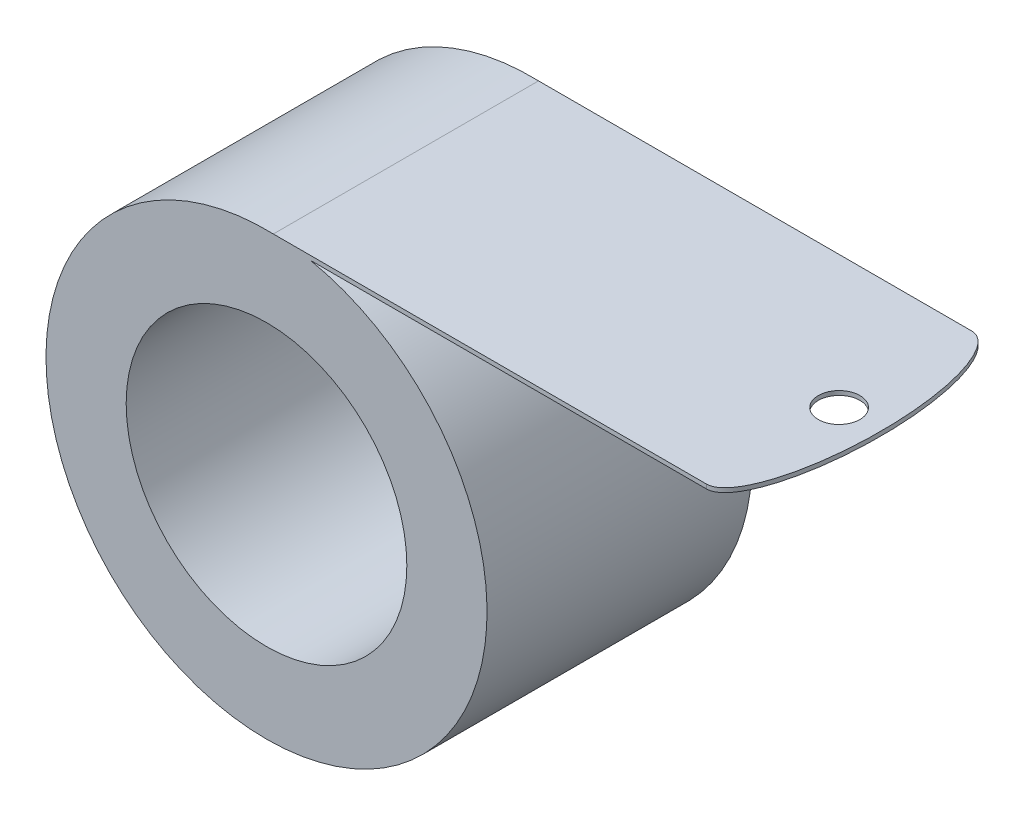
ISO-10303-21;
HEADER;
FILE_DESCRIPTION(('STEP AP214'),'2;1');
FILE_NAME('part.step','',(''),(''),'','','');
FILE_SCHEMA(('AUTOMOTIVE_DESIGN { 1 0 10303 214 1 1 1 1 }'));
ENDSEC;
DATA;
#1=APPLICATION_CONTEXT('core data for automotive mechanical design processes');
#2=APPLICATION_PROTOCOL_DEFINITION('international standard','automotive_design',2000,#1);
#3=PRODUCT_CONTEXT('',#1,'mechanical');
#4=PRODUCT('Part','Part','',(#3));
#5=PRODUCT_RELATED_PRODUCT_CATEGORY('part','',(#4));
#6=PRODUCT_DEFINITION_FORMATION('','',#4);
#7=PRODUCT_DEFINITION_CONTEXT('part definition',#1,'design');
#8=PRODUCT_DEFINITION('design','',#6,#7);
#9=PRODUCT_DEFINITION_SHAPE('','',#8);
#10=(LENGTH_UNIT() NAMED_UNIT(*) SI_UNIT(.MILLI.,.METRE.));
#11=(NAMED_UNIT(*) PLANE_ANGLE_UNIT() SI_UNIT($,.RADIAN.));
#12=(NAMED_UNIT(*) SI_UNIT($,.STERADIAN.) SOLID_ANGLE_UNIT());
#13=UNCERTAINTY_MEASURE_WITH_UNIT(LENGTH_MEASURE(1.E-05),#10,'distance_accuracy_value','');
#14=(GEOMETRIC_REPRESENTATION_CONTEXT(3) GLOBAL_UNCERTAINTY_ASSIGNED_CONTEXT((#13)) GLOBAL_UNIT_ASSIGNED_CONTEXT((#10,
#11,#12)) REPRESENTATION_CONTEXT('',''));
#15=CARTESIAN_POINT('',(0.,0.,0.));
#16=DIRECTION('',(0.,0.,1.));
#17=DIRECTION('',(1.,0.,0.));
#18=AXIS2_PLACEMENT_3D('',#15,#16,#17);
#19=CARTESIAN_POINT('',(0.,0.,31.75));
#20=DIRECTION('',(0.,0.,1.));
#21=DIRECTION('',(1.,0.,0.));
#22=AXIS2_PLACEMENT_3D('',#19,#20,#21);
#23=PLANE('',#22);
#24=DIRECTION('',(1.,0.,0.));
#25=VECTOR('',#24,1.);
#26=CARTESIAN_POINT('',(0.,26.3906,31.75));
#27=LINE('',#26,#25);
#28=CARTESIAN_POINT('',(0.818829976246884,26.3906,31.75));
#29=VERTEX_POINT('',#28);
#30=CARTESIAN_POINT('',(52.6813929222527,26.3906,31.75));
#31=VERTEX_POINT('',#30);
#32=EDGE_CURVE('E80',#29,#31,#27,.T.);
#33=ORIENTED_EDGE('',*,*,#32,.F.);
#34=CARTESIAN_POINT('',(0.,0.,31.75));
#35=DIRECTION('',(0.,0.,1.));
#36=DIRECTION('',(1.,0.,0.));
#37=AXIS2_PLACEMENT_3D('',#34,#35,#36);
#38=CIRCLE('',#37,26.4033);
#39=CARTESIAN_POINT('',(5.21778383319973,25.8826,31.75));
#40=VERTEX_POINT('',#39);
#41=EDGE_CURVE('E61',#29,#40,#38,.T.);
#42=ORIENTED_EDGE('',*,*,#41,.T.);
#43=DIRECTION('',(1.,0.,0.));
#44=VECTOR('',#43,1.);
#45=CARTESIAN_POINT('',(0.,25.8826,31.75));
#46=LINE('',#45,#44);
#47=CARTESIAN_POINT('',(52.6813929222527,25.8826,31.75));
#48=VERTEX_POINT('',#47);
#49=EDGE_CURVE('E101',#40,#48,#46,.T.);
#50=ORIENTED_EDGE('',*,*,#49,.T.);
#51=DIRECTION('',(0.,-1.,0.));
#52=VECTOR('',#51,1.);
#53=CARTESIAN_POINT('',(52.6813929222527,26.3906,31.75));
#54=LINE('',#53,#52);
#55=EDGE_CURVE('E93',#31,#48,#54,.T.);
#56=ORIENTED_EDGE('',*,*,#55,.F.);
#57=EDGE_LOOP('',(#33,#42,#50,#56));
#58=FACE_BOUND('',#57,.T.);
#59=CARTESIAN_POINT('',(0.,0.,31.75));
#60=DIRECTION('',(0.,0.,1.));
#61=DIRECTION('',(1.,0.,0.));
#62=AXIS2_PLACEMENT_3D('',#59,#60,#61);
#63=CIRCLE('',#62,16.8021);
#64=CARTESIAN_POINT('',(16.8021,0.,31.75));
#65=VERTEX_POINT('',#64);
#66=EDGE_CURVE('E107',#65,#65,#63,.T.);
#67=ORIENTED_EDGE('',*,*,#66,.F.);
#68=EDGE_LOOP('',(#67));
#69=FACE_BOUND('',#68,.T.);
#70=ADVANCED_FACE('F39',(#58,#69),#23,.T.);
#71=CARTESIAN_POINT('',(0.,0.,0.));
#72=DIRECTION('',(0.,0.,1.));
#73=DIRECTION('',(1.,0.,0.));
#74=AXIS2_PLACEMENT_3D('',#71,#72,#73);
#75=PLANE('',#74);
#76=CARTESIAN_POINT('',(0.,0.,0.));
#77=DIRECTION('',(0.,0.,1.));
#78=DIRECTION('',(1.,0.,0.));
#79=AXIS2_PLACEMENT_3D('',#76,#77,#78);
#80=CIRCLE('',#79,26.4033);
#81=CARTESIAN_POINT('',(0.818829976246884,26.3906,0.));
#82=VERTEX_POINT('',#81);
#83=CARTESIAN_POINT('',(5.21778383319973,25.8826,0.));
#84=VERTEX_POINT('',#83);
#85=EDGE_CURVE('E56',#82,#84,#80,.T.);
#86=ORIENTED_EDGE('',*,*,#85,.F.);
#87=DIRECTION('',(-1.,0.,0.));
#88=VECTOR('',#87,1.);
#89=CARTESIAN_POINT('',(0.,26.3906,0.));
#90=LINE('',#89,#88);
#91=CARTESIAN_POINT('',(52.6813929222527,26.3906,0.));
#92=VERTEX_POINT('',#91);
#93=EDGE_CURVE('E97',#92,#82,#90,.T.);
#94=ORIENTED_EDGE('',*,*,#93,.F.);
#95=DIRECTION('',(0.,-1.,0.));
#96=VECTOR('',#95,1.);
#97=CARTESIAN_POINT('',(52.6813929222527,26.3906,0.));
#98=LINE('',#97,#96);
#99=CARTESIAN_POINT('',(52.6813929222527,25.8826,0.));
#100=VERTEX_POINT('',#99);
#101=EDGE_CURVE('E95',#92,#100,#98,.T.);
#102=ORIENTED_EDGE('',*,*,#101,.T.);
#103=DIRECTION('',(-1.,0.,0.));
#104=VECTOR('',#103,1.);
#105=CARTESIAN_POINT('',(0.,25.8826,0.));
#106=LINE('',#105,#104);
#107=EDGE_CURVE('E88',#100,#84,#106,.T.);
#108=ORIENTED_EDGE('',*,*,#107,.T.);
#109=EDGE_LOOP('',(#86,#94,#102,#108));
#110=FACE_BOUND('',#109,.T.);
#111=CARTESIAN_POINT('',(0.,0.,0.));
#112=DIRECTION('',(0.,0.,1.));
#113=DIRECTION('',(1.,0.,0.));
#114=AXIS2_PLACEMENT_3D('',#111,#112,#113);
#115=CIRCLE('',#114,16.8021);
#116=CARTESIAN_POINT('',(16.8021,0.,0.));
#117=VERTEX_POINT('',#116);
#118=EDGE_CURVE('E103',#117,#117,#115,.T.);
#119=ORIENTED_EDGE('',*,*,#118,.T.);
#120=EDGE_LOOP('',(#119));
#121=FACE_BOUND('',#120,.T.);
#122=ADVANCED_FACE('F124',(#110,#121),#75,.F.);
#123=CARTESIAN_POINT('',(0.,0.,31.75));
#124=DIRECTION('',(0.,0.,-1.));
#125=DIRECTION('',(-1.,0.,0.));
#126=AXIS2_PLACEMENT_3D('',#123,#124,#125);
#127=CYLINDRICAL_SURFACE('',#126,26.4033);
#128=ORIENTED_EDGE('',*,*,#41,.F.);
#129=DIRECTION('',(0.,0.,-1.));
#130=VECTOR('',#129,1.);
#131=CARTESIAN_POINT('',(0.818829976246884,26.3906,31.75));
#132=LINE('',#131,#130);
#133=EDGE_CURVE('E11',#29,#82,#132,.T.);
#134=ORIENTED_EDGE('',*,*,#133,.T.);
#135=ORIENTED_EDGE('',*,*,#85,.T.);
#136=DIRECTION('',(0.,0.,-1.));
#137=VECTOR('',#136,1.);
#138=CARTESIAN_POINT('',(5.21778383319973,25.8826,31.75));
#139=LINE('',#138,#137);
#140=EDGE_CURVE('E48',#40,#84,#139,.T.);
#141=ORIENTED_EDGE('',*,*,#140,.F.);
#142=EDGE_LOOP('',(#128,#134,#135,#141));
#143=FACE_BOUND('',#142,.T.);
#144=ADVANCED_FACE('F41',(#143),#127,.T.);
#145=CARTESIAN_POINT('',(0.,0.,31.75));
#146=DIRECTION('',(0.,0.,-1.));
#147=DIRECTION('',(-1.,0.,0.));
#148=AXIS2_PLACEMENT_3D('',#145,#146,#147);
#149=CYLINDRICAL_SURFACE('',#148,16.8021);
#150=ORIENTED_EDGE('',*,*,#66,.T.);
#151=EDGE_LOOP('',(#150));
#152=FACE_BOUND('',#151,.T.);
#153=ORIENTED_EDGE('',*,*,#118,.F.);
#154=EDGE_LOOP('',(#153));
#155=FACE_BOUND('',#154,.T.);
#156=ADVANCED_FACE('F140',(#152,#155),#149,.F.);
#157=CARTESIAN_POINT('',(52.6813929222527,26.3906,15.875));
#158=DIRECTION('',(0.,1.,0.));
#159=DIRECTION('',(0.,0.,1.));
#160=AXIS2_PLACEMENT_3D('',#157,#158,#159);
#161=PLANE('',#160);
#162=CARTESIAN_POINT('',(52.6813929222527,26.3906,15.875));
#163=DIRECTION('',(0.,1.,0.));
#164=DIRECTION('',(0.,0.,1.));
#165=AXIS2_PLACEMENT_3D('',#162,#163,#164);
#166=CIRCLE('',#165,2.4892);
#167=CARTESIAN_POINT('',(52.6813929222527,26.3906,18.3642));
#168=VERTEX_POINT('',#167);
#169=EDGE_CURVE('E130',#168,#168,#166,.T.);
#170=ORIENTED_EDGE('',*,*,#169,.F.);
#171=EDGE_LOOP('',(#170));
#172=FACE_BOUND('',#171,.T.);
#173=ORIENTED_EDGE('',*,*,#133,.F.);
#174=ORIENTED_EDGE('',*,*,#32,.T.);
#175=CARTESIAN_POINT('',(52.6813929222527,26.3906,15.875));
#176=DIRECTION('',(0.,1.,0.));
#177=DIRECTION('',(0.,0.,-1.));
#178=AXIS2_PLACEMENT_3D('',#175,#176,#177);
#179=ELLIPSE('',#178,15.875,4.96076596719774);
#180=EDGE_CURVE('E84',#31,#92,#179,.T.);
#181=ORIENTED_EDGE('',*,*,#180,.T.);
#182=ORIENTED_EDGE('',*,*,#93,.T.);
#183=EDGE_LOOP('',(#173,#174,#181,#182));
#184=FACE_BOUND('',#183,.T.);
#185=ADVANCED_FACE('F82',(#172,#184),#161,.T.);
#186=CARTESIAN_POINT('',(52.6813929222527,25.8826,15.875));
#187=DIRECTION('',(0.,1.,0.));
#188=DIRECTION('',(0.,0.,1.));
#189=AXIS2_PLACEMENT_3D('',#186,#187,#188);
#190=PLANE('',#189);
#191=CARTESIAN_POINT('',(52.6813929222527,25.8826,15.875));
#192=DIRECTION('',(0.,1.,0.));
#193=DIRECTION('',(0.,0.,1.));
#194=AXIS2_PLACEMENT_3D('',#191,#192,#193);
#195=CIRCLE('',#194,2.4892);
#196=CARTESIAN_POINT('',(52.6813929222527,25.8826,18.3642));
#197=VERTEX_POINT('',#196);
#198=EDGE_CURVE('E217',#197,#197,#195,.T.);
#199=ORIENTED_EDGE('',*,*,#198,.T.);
#200=EDGE_LOOP('',(#199));
#201=FACE_BOUND('',#200,.T.);
#202=ORIENTED_EDGE('',*,*,#49,.F.);
#203=ORIENTED_EDGE('',*,*,#140,.T.);
#204=ORIENTED_EDGE('',*,*,#107,.F.);
#205=CARTESIAN_POINT('',(52.6813929222527,25.8826,15.875));
#206=DIRECTION('',(0.,1.,0.));
#207=DIRECTION('',(0.,0.,-1.));
#208=AXIS2_PLACEMENT_3D('',#205,#206,#207);
#209=ELLIPSE('',#208,15.875,4.96076596719774);
#210=EDGE_CURVE('E126',#48,#100,#209,.T.);
#211=ORIENTED_EDGE('',*,*,#210,.F.);
#212=EDGE_LOOP('',(#202,#203,#204,#211));
#213=FACE_BOUND('',#212,.T.);
#214=ADVANCED_FACE('F122',(#201,#213),#190,.F.);
#215=DIRECTION('',(0.,-1.,0.));
#216=VECTOR('',#215,1.);
#217=SURFACE_OF_LINEAR_EXTRUSION('',#179,#216);
#218=ORIENTED_EDGE('',*,*,#210,.T.);
#219=ORIENTED_EDGE('',*,*,#101,.F.);
#220=ORIENTED_EDGE('',*,*,#180,.F.);
#221=ORIENTED_EDGE('',*,*,#55,.T.);
#222=EDGE_LOOP('',(#218,#219,#220,#221));
#223=FACE_BOUND('',#222,.T.);
#224=ADVANCED_FACE('F92',(#223),#217,.F.);
#225=CARTESIAN_POINT('',(52.6813929222527,26.3906,15.875));
#226=DIRECTION('',(0.,-1.,0.));
#227=DIRECTION('',(0.,0.,-1.));
#228=AXIS2_PLACEMENT_3D('',#225,#226,#227);
#229=CYLINDRICAL_SURFACE('',#228,2.4892);
#230=ORIENTED_EDGE('',*,*,#169,.T.);
#231=EDGE_LOOP('',(#230));
#232=FACE_BOUND('',#231,.T.);
#233=ORIENTED_EDGE('',*,*,#198,.F.);
#234=EDGE_LOOP('',(#233));
#235=FACE_BOUND('',#234,.T.);
#236=ADVANCED_FACE('F138',(#232,#235),#229,.F.);
#237=CLOSED_SHELL('',(#70,#122,#144,#156,#185,#214,#224,#236));
#238=MANIFOLD_SOLID_BREP('B2',#237);
#239=ADVANCED_BREP_SHAPE_REPRESENTATION('',(#18,#238),#14);
#240=SHAPE_DEFINITION_REPRESENTATION(#9,#239);
ENDSEC;
END-ISO-10303-21;
